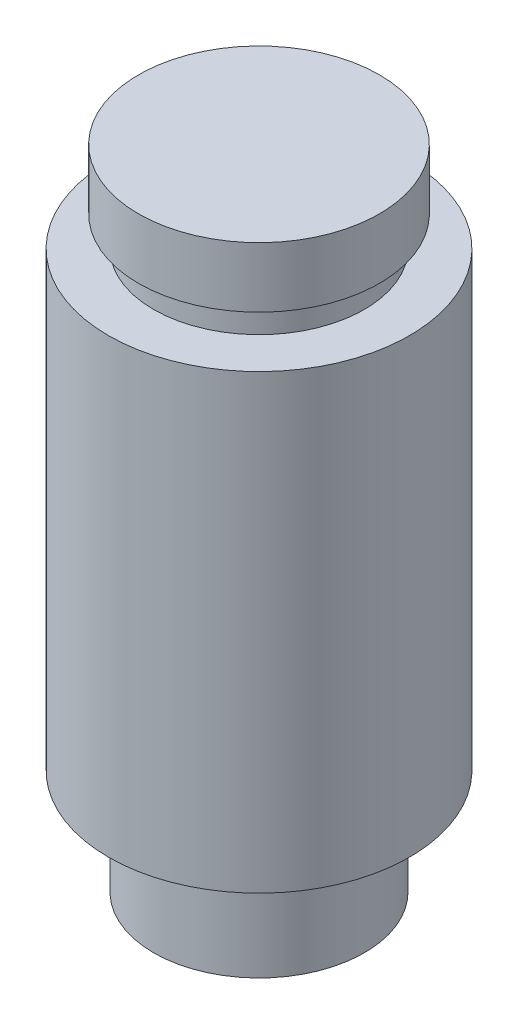
ISO-10303-21;
HEADER;
FILE_DESCRIPTION(('STEP AP214'),'2;1');
FILE_NAME('part.step','',(''),(''),'','','');
FILE_SCHEMA(('AUTOMOTIVE_DESIGN { 1 0 10303 214 1 1 1 1 }'));
ENDSEC;
DATA;
#1=APPLICATION_CONTEXT('core data for automotive mechanical design processes');
#2=APPLICATION_PROTOCOL_DEFINITION('international standard','automotive_design',2000,#1);
#3=PRODUCT_CONTEXT('',#1,'mechanical');
#4=PRODUCT('Part','Part','',(#3));
#5=PRODUCT_RELATED_PRODUCT_CATEGORY('part','',(#4));
#6=PRODUCT_DEFINITION_FORMATION('','',#4);
#7=PRODUCT_DEFINITION_CONTEXT('part definition',#1,'design');
#8=PRODUCT_DEFINITION('design','',#6,#7);
#9=PRODUCT_DEFINITION_SHAPE('','',#8);
#10=(LENGTH_UNIT() NAMED_UNIT(*) SI_UNIT(.MILLI.,.METRE.));
#11=(NAMED_UNIT(*) PLANE_ANGLE_UNIT() SI_UNIT($,.RADIAN.));
#12=(NAMED_UNIT(*) SI_UNIT($,.STERADIAN.) SOLID_ANGLE_UNIT());
#13=UNCERTAINTY_MEASURE_WITH_UNIT(LENGTH_MEASURE(1.E-05),#10,'distance_accuracy_value','');
#14=(GEOMETRIC_REPRESENTATION_CONTEXT(3) GLOBAL_UNCERTAINTY_ASSIGNED_CONTEXT((#13)) GLOBAL_UNIT_ASSIGNED_CONTEXT((#10,
#11,#12)) REPRESENTATION_CONTEXT('',''));
#15=CARTESIAN_POINT('',(0.,0.,0.));
#16=DIRECTION('',(0.,0.,1.));
#17=DIRECTION('',(1.,0.,0.));
#18=AXIS2_PLACEMENT_3D('',#15,#16,#17);
#19=CARTESIAN_POINT('',(8.89,0.,0.));
#20=DIRECTION('',(0.,-1.,0.));
#21=DIRECTION('',(0.,0.,-1.));
#22=AXIS2_PLACEMENT_3D('',#19,#20,#21);
#23=PLANE('',#22);
#24=CARTESIAN_POINT('',(0.,0.,0.));
#25=DIRECTION('',(0.,-1.,0.));
#26=DIRECTION('',(0.,0.,-1.));
#27=AXIS2_PLACEMENT_3D('',#24,#25,#26);
#28=CIRCLE('',#27,8.89);
#29=CARTESIAN_POINT('',(0.,0.,-8.89));
#30=VERTEX_POINT('',#29);
#31=EDGE_CURVE('E59',#30,#30,#28,.T.);
#32=ORIENTED_EDGE('',*,*,#31,.T.);
#33=EDGE_LOOP('',(#32));
#34=FACE_BOUND('',#33,.T.);
#35=ADVANCED_FACE('F31',(#34),#23,.T.);
#36=CARTESIAN_POINT('',(0.,54.61,0.));
#37=DIRECTION('',(0.,1.,0.));
#38=DIRECTION('',(0.,0.,1.));
#39=AXIS2_PLACEMENT_3D('',#36,#37,#38);
#40=PLANE('',#39);
#41=CARTESIAN_POINT('',(0.,54.61,0.));
#42=DIRECTION('',(0.,-1.,0.));
#43=DIRECTION('',(0.,0.,-1.));
#44=AXIS2_PLACEMENT_3D('',#41,#42,#43);
#45=CIRCLE('',#44,10.16);
#46=CARTESIAN_POINT('',(0.,54.61,-10.16));
#47=VERTEX_POINT('',#46);
#48=EDGE_CURVE('E10',#47,#47,#45,.T.);
#49=ORIENTED_EDGE('',*,*,#48,.F.);
#50=EDGE_LOOP('',(#49));
#51=FACE_BOUND('',#50,.T.);
#52=ADVANCED_FACE('F76',(#51),#40,.T.);
#53=CARTESIAN_POINT('',(0.,0.,0.));
#54=DIRECTION('',(0.,-1.,0.));
#55=DIRECTION('',(0.,0.,-1.));
#56=AXIS2_PLACEMENT_3D('',#53,#54,#55);
#57=CYLINDRICAL_SURFACE('',#56,10.16);
#58=ORIENTED_EDGE('',*,*,#48,.T.);
#59=EDGE_LOOP('',(#58));
#60=FACE_BOUND('',#59,.T.);
#61=CARTESIAN_POINT('',(0.,49.53,0.));
#62=DIRECTION('',(0.,-1.,0.));
#63=DIRECTION('',(0.,0.,-1.));
#64=AXIS2_PLACEMENT_3D('',#61,#62,#63);
#65=CIRCLE('',#64,10.16);
#66=CARTESIAN_POINT('',(0.,49.53,-10.16));
#67=VERTEX_POINT('',#66);
#68=EDGE_CURVE('E37',#67,#67,#65,.T.);
#69=ORIENTED_EDGE('',*,*,#68,.F.);
#70=EDGE_LOOP('',(#69));
#71=FACE_BOUND('',#70,.T.);
#72=ADVANCED_FACE('F80',(#60,#71),#57,.T.);
#73=CARTESIAN_POINT('',(10.16,49.53,0.));
#74=DIRECTION('',(0.,-1.,0.));
#75=DIRECTION('',(0.,0.,-1.));
#76=AXIS2_PLACEMENT_3D('',#73,#74,#75);
#77=PLANE('',#76);
#78=ORIENTED_EDGE('',*,*,#68,.T.);
#79=EDGE_LOOP('',(#78));
#80=FACE_BOUND('',#79,.T.);
#81=CARTESIAN_POINT('',(0.,49.53,0.));
#82=DIRECTION('',(0.,-1.,0.));
#83=DIRECTION('',(0.,0.,-1.));
#84=AXIS2_PLACEMENT_3D('',#81,#82,#83);
#85=CIRCLE('',#84,8.89);
#86=CARTESIAN_POINT('',(0.,49.53,-8.89));
#87=VERTEX_POINT('',#86);
#88=EDGE_CURVE('E41',#87,#87,#85,.T.);
#89=ORIENTED_EDGE('',*,*,#88,.F.);
#90=EDGE_LOOP('',(#89));
#91=FACE_BOUND('',#90,.T.);
#92=ADVANCED_FACE('F85',(#80,#91),#77,.T.);
#93=CARTESIAN_POINT('',(0.,0.,0.));
#94=DIRECTION('',(0.,-1.,0.));
#95=DIRECTION('',(0.,0.,-1.));
#96=AXIS2_PLACEMENT_3D('',#93,#94,#95);
#97=CYLINDRICAL_SURFACE('',#96,8.89);
#98=ORIENTED_EDGE('',*,*,#88,.T.);
#99=EDGE_LOOP('',(#98));
#100=FACE_BOUND('',#99,.T.);
#101=CARTESIAN_POINT('',(0.,46.99,0.));
#102=DIRECTION('',(0.,-1.,0.));
#103=DIRECTION('',(0.,0.,-1.));
#104=AXIS2_PLACEMENT_3D('',#101,#102,#103);
#105=CIRCLE('',#104,8.89);
#106=CARTESIAN_POINT('',(0.,46.99,-8.89));
#107=VERTEX_POINT('',#106);
#108=EDGE_CURVE('E45',#107,#107,#105,.T.);
#109=ORIENTED_EDGE('',*,*,#108,.F.);
#110=EDGE_LOOP('',(#109));
#111=FACE_BOUND('',#110,.T.);
#112=ADVANCED_FACE('F90',(#100,#111),#97,.T.);
#113=CARTESIAN_POINT('',(8.89,46.99,0.));
#114=DIRECTION('',(0.,1.,0.));
#115=DIRECTION('',(0.,0.,1.));
#116=AXIS2_PLACEMENT_3D('',#113,#114,#115);
#117=PLANE('',#116);
#118=ORIENTED_EDGE('',*,*,#108,.T.);
#119=EDGE_LOOP('',(#118));
#120=FACE_BOUND('',#119,.T.);
#121=CARTESIAN_POINT('',(0.,46.99,0.));
#122=DIRECTION('',(0.,-1.,0.));
#123=DIRECTION('',(0.,0.,-1.));
#124=AXIS2_PLACEMENT_3D('',#121,#122,#123);
#125=CIRCLE('',#124,12.7);
#126=CARTESIAN_POINT('',(0.,46.99,-12.7));
#127=VERTEX_POINT('',#126);
#128=EDGE_CURVE('E50',#127,#127,#125,.T.);
#129=ORIENTED_EDGE('',*,*,#128,.F.);
#130=EDGE_LOOP('',(#129));
#131=FACE_BOUND('',#130,.T.);
#132=ADVANCED_FACE('F93',(#120,#131),#117,.T.);
#133=CARTESIAN_POINT('',(0.,0.,0.));
#134=DIRECTION('',(0.,-1.,0.));
#135=DIRECTION('',(0.,0.,-1.));
#136=AXIS2_PLACEMENT_3D('',#133,#134,#135);
#137=CYLINDRICAL_SURFACE('',#136,12.7);
#138=ORIENTED_EDGE('',*,*,#128,.T.);
#139=EDGE_LOOP('',(#138));
#140=FACE_BOUND('',#139,.T.);
#141=CARTESIAN_POINT('',(0.,8.89,0.));
#142=DIRECTION('',(0.,-1.,0.));
#143=DIRECTION('',(0.,0.,-1.));
#144=AXIS2_PLACEMENT_3D('',#141,#142,#143);
#145=CIRCLE('',#144,12.7);
#146=CARTESIAN_POINT('',(0.,8.89,-12.7));
#147=VERTEX_POINT('',#146);
#148=EDGE_CURVE('E53',#147,#147,#145,.T.);
#149=ORIENTED_EDGE('',*,*,#148,.F.);
#150=EDGE_LOOP('',(#149));
#151=FACE_BOUND('',#150,.T.);
#152=ADVANCED_FACE('F72',(#140,#151),#137,.T.);
#153=CARTESIAN_POINT('',(12.7,8.89,0.));
#154=DIRECTION('',(0.,-1.,0.));
#155=DIRECTION('',(0.,0.,-1.));
#156=AXIS2_PLACEMENT_3D('',#153,#154,#155);
#157=PLANE('',#156);
#158=ORIENTED_EDGE('',*,*,#148,.T.);
#159=EDGE_LOOP('',(#158));
#160=FACE_BOUND('',#159,.T.);
#161=CARTESIAN_POINT('',(0.,8.89,0.));
#162=DIRECTION('',(0.,-1.,0.));
#163=DIRECTION('',(0.,0.,-1.));
#164=AXIS2_PLACEMENT_3D('',#161,#162,#163);
#165=CIRCLE('',#164,8.89);
#166=CARTESIAN_POINT('',(0.,8.89,-8.89));
#167=VERTEX_POINT('',#166);
#168=EDGE_CURVE('E56',#167,#167,#165,.T.);
#169=ORIENTED_EDGE('',*,*,#168,.F.);
#170=EDGE_LOOP('',(#169));
#171=FACE_BOUND('',#170,.T.);
#172=ADVANCED_FACE('F66',(#160,#171),#157,.T.);
#173=CARTESIAN_POINT('',(0.,0.,0.));
#174=DIRECTION('',(0.,-1.,0.));
#175=DIRECTION('',(0.,0.,-1.));
#176=AXIS2_PLACEMENT_3D('',#173,#174,#175);
#177=CYLINDRICAL_SURFACE('',#176,8.89);
#178=ORIENTED_EDGE('',*,*,#168,.T.);
#179=EDGE_LOOP('',(#178));
#180=FACE_BOUND('',#179,.T.);
#181=ORIENTED_EDGE('',*,*,#31,.F.);
#182=EDGE_LOOP('',(#181));
#183=FACE_BOUND('',#182,.T.);
#184=ADVANCED_FACE('F64',(#180,#183),#177,.T.);
#185=CLOSED_SHELL('',(#35,#52,#72,#92,#112,#132,#152,#172,#184));
#186=MANIFOLD_SOLID_BREP('B2',#185);
#187=ADVANCED_BREP_SHAPE_REPRESENTATION('',(#18,#186),#14);
#188=SHAPE_DEFINITION_REPRESENTATION(#9,#187);
ENDSEC;
END-ISO-10303-21;
